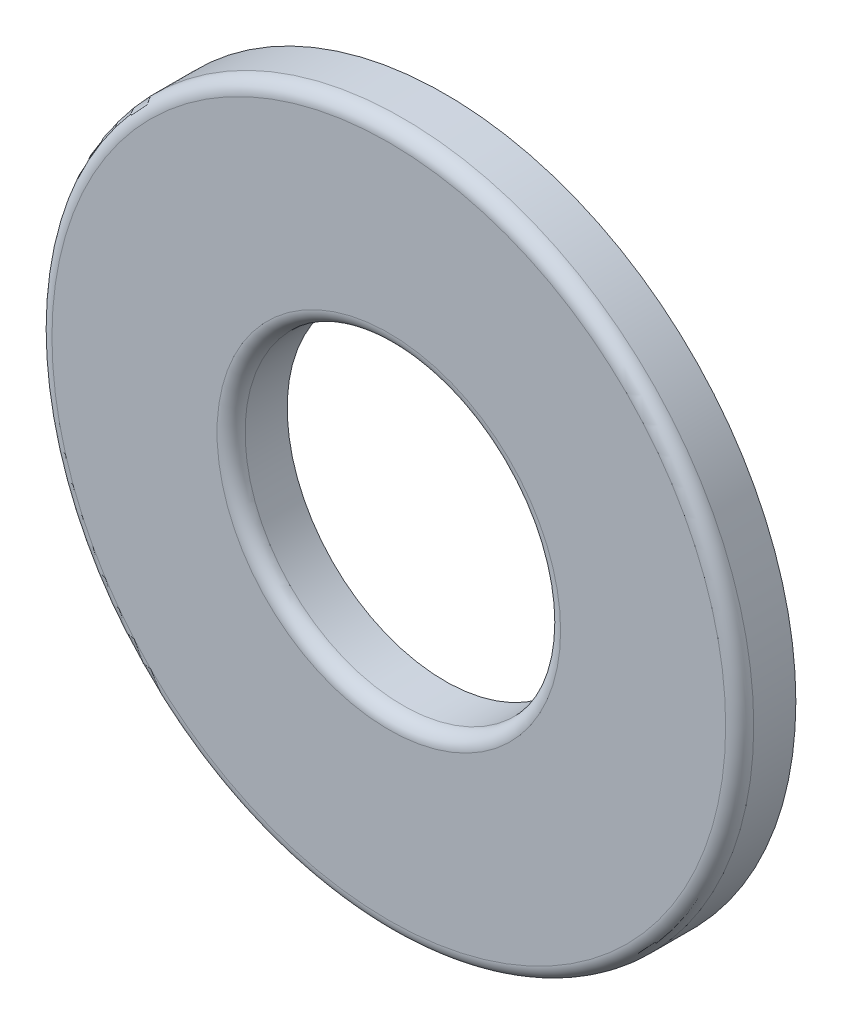
ISO-10303-21;
HEADER;
FILE_DESCRIPTION(('STEP AP214'),'2;1');
FILE_NAME('part.step','',(''),(''),'','','');
FILE_SCHEMA(('AUTOMOTIVE_DESIGN { 1 0 10303 214 1 1 1 1 }'));
ENDSEC;
DATA;
#1=APPLICATION_CONTEXT('core data for automotive mechanical design processes');
#2=APPLICATION_PROTOCOL_DEFINITION('international standard','automotive_design',2000,#1);
#3=PRODUCT_CONTEXT('',#1,'mechanical');
#4=PRODUCT('Part','Part','',(#3));
#5=PRODUCT_RELATED_PRODUCT_CATEGORY('part','',(#4));
#6=PRODUCT_DEFINITION_FORMATION('','',#4);
#7=PRODUCT_DEFINITION_CONTEXT('part definition',#1,'design');
#8=PRODUCT_DEFINITION('design','',#6,#7);
#9=PRODUCT_DEFINITION_SHAPE('','',#8);
#10=(LENGTH_UNIT() NAMED_UNIT(*) SI_UNIT(.MILLI.,.METRE.));
#11=(NAMED_UNIT(*) PLANE_ANGLE_UNIT() SI_UNIT($,.RADIAN.));
#12=(NAMED_UNIT(*) SI_UNIT($,.STERADIAN.) SOLID_ANGLE_UNIT());
#13=UNCERTAINTY_MEASURE_WITH_UNIT(LENGTH_MEASURE(1.E-05),#10,'distance_accuracy_value','');
#14=(GEOMETRIC_REPRESENTATION_CONTEXT(3) GLOBAL_UNCERTAINTY_ASSIGNED_CONTEXT((#13)) GLOBAL_UNIT_ASSIGNED_CONTEXT((#10,
#11,#12)) REPRESENTATION_CONTEXT('',''));
#15=CARTESIAN_POINT('',(0.,0.,0.));
#16=DIRECTION('',(0.,0.,1.));
#17=DIRECTION('',(1.,0.,0.));
#18=AXIS2_PLACEMENT_3D('',#15,#16,#17);
#19=CARTESIAN_POINT('',(0.,0.,0.634999999999997));
#20=DIRECTION('',(0.,0.,1.));
#21=DIRECTION('',(1.,0.,0.));
#22=AXIS2_PLACEMENT_3D('',#19,#20,#21);
#23=PLANE('',#22);
#24=CARTESIAN_POINT('',(0.,0.,0.634999999999997));
#25=DIRECTION('',(0.,0.,1.));
#26=DIRECTION('',(1.,0.,0.));
#27=AXIS2_PLACEMENT_3D('',#24,#25,#26);
#28=CIRCLE('',#27,7.62);
#29=CARTESIAN_POINT('',(7.62,0.,0.634999999999997));
#30=VERTEX_POINT('',#29);
#31=EDGE_CURVE('E50',#30,#30,#28,.T.);
#32=ORIENTED_EDGE('',*,*,#31,.T.);
#33=EDGE_LOOP('',(#32));
#34=FACE_BOUND('',#33,.T.);
#35=CARTESIAN_POINT('',(0.,0.,0.634999999999997));
#36=DIRECTION('',(0.,0.,1.));
#37=DIRECTION('',(1.,0.,0.));
#38=AXIS2_PLACEMENT_3D('',#35,#36,#37);
#39=CIRCLE('',#38,3.8862);
#40=CARTESIAN_POINT('',(3.8862,0.,0.634999999999997));
#41=VERTEX_POINT('',#40);
#42=EDGE_CURVE('E54',#41,#41,#39,.F.);
#43=ORIENTED_EDGE('',*,*,#42,.T.);
#44=EDGE_LOOP('',(#43));
#45=FACE_BOUND('',#44,.T.);
#46=ADVANCED_FACE('F39',(#34,#45),#23,.T.);
#47=CARTESIAN_POINT('',(0.,0.,0.634999999999997));
#48=DIRECTION('',(0.,0.,-1.));
#49=DIRECTION('',(-1.,0.,0.));
#50=AXIS2_PLACEMENT_3D('',#47,#48,#49);
#51=CYLINDRICAL_SURFACE('',#50,7.9375);
#52=CARTESIAN_POINT('',(0.,0.,0.317499999999997));
#53=DIRECTION('',(0.,0.,1.));
#54=DIRECTION('',(1.,0.,0.));
#55=AXIS2_PLACEMENT_3D('',#52,#53,#54);
#56=CIRCLE('',#55,7.9375);
#57=CARTESIAN_POINT('',(7.9375,0.,0.317499999999997));
#58=VERTEX_POINT('',#57);
#59=EDGE_CURVE('E46',#58,#58,#56,.F.);
#60=ORIENTED_EDGE('',*,*,#59,.T.);
#61=EDGE_LOOP('',(#60));
#62=FACE_BOUND('',#61,.T.);
#63=CARTESIAN_POINT('',(0.,0.,-0.635000000000003));
#64=DIRECTION('',(0.,0.,1.));
#65=DIRECTION('',(1.,0.,0.));
#66=AXIS2_PLACEMENT_3D('',#63,#64,#65);
#67=CIRCLE('',#66,7.9375);
#68=CARTESIAN_POINT('',(7.9375,0.,-0.635000000000003));
#69=VERTEX_POINT('',#68);
#70=EDGE_CURVE('E59',#69,#69,#67,.T.);
#71=ORIENTED_EDGE('',*,*,#70,.T.);
#72=EDGE_LOOP('',(#71));
#73=FACE_BOUND('',#72,.T.);
#74=ADVANCED_FACE('F71',(#62,#73),#51,.T.);
#75=CARTESIAN_POINT('',(0.,0.,0.634999999999997));
#76=DIRECTION('',(0.,0.,-1.));
#77=DIRECTION('',(-1.,0.,0.));
#78=AXIS2_PLACEMENT_3D('',#75,#76,#77);
#79=CYLINDRICAL_SURFACE('',#78,3.5687);
#80=CARTESIAN_POINT('',(0.,0.,0.317499999999997));
#81=DIRECTION('',(0.,0.,1.));
#82=DIRECTION('',(1.,0.,0.));
#83=AXIS2_PLACEMENT_3D('',#80,#81,#82);
#84=CIRCLE('',#83,3.5687);
#85=CARTESIAN_POINT('',(3.5687,0.,0.317499999999997));
#86=VERTEX_POINT('',#85);
#87=EDGE_CURVE('E10',#86,#86,#84,.T.);
#88=ORIENTED_EDGE('',*,*,#87,.T.);
#89=EDGE_LOOP('',(#88));
#90=FACE_BOUND('',#89,.T.);
#91=CARTESIAN_POINT('',(0.,0.,-0.635000000000003));
#92=DIRECTION('',(0.,0.,1.));
#93=DIRECTION('',(1.,0.,0.));
#94=AXIS2_PLACEMENT_3D('',#91,#92,#93);
#95=CIRCLE('',#94,3.5687);
#96=CARTESIAN_POINT('',(3.5687,0.,-0.635000000000003));
#97=VERTEX_POINT('',#96);
#98=EDGE_CURVE('E62',#97,#97,#95,.T.);
#99=ORIENTED_EDGE('',*,*,#98,.F.);
#100=EDGE_LOOP('',(#99));
#101=FACE_BOUND('',#100,.T.);
#102=ADVANCED_FACE('F69',(#90,#101),#79,.F.);
#103=CARTESIAN_POINT('',(0.,0.,-0.635000000000003));
#104=DIRECTION('',(0.,0.,1.));
#105=DIRECTION('',(1.,0.,0.));
#106=AXIS2_PLACEMENT_3D('',#103,#104,#105);
#107=PLANE('',#106);
#108=ORIENTED_EDGE('',*,*,#98,.T.);
#109=EDGE_LOOP('',(#108));
#110=FACE_BOUND('',#109,.T.);
#111=ORIENTED_EDGE('',*,*,#70,.F.);
#112=EDGE_LOOP('',(#111));
#113=FACE_BOUND('',#112,.T.);
#114=ADVANCED_FACE('F66',(#110,#113),#107,.F.);
#115=CARTESIAN_POINT('',(0.,0.,0.317499999999997));
#116=DIRECTION('',(0.,0.,1.));
#117=DIRECTION('',(1.,0.,0.));
#118=AXIS2_PLACEMENT_3D('',#115,#116,#117);
#119=TOROIDAL_SURFACE('',#118,7.62,0.3175);
#120=ORIENTED_EDGE('',*,*,#59,.F.);
#121=EDGE_LOOP('',(#120));
#122=FACE_BOUND('',#121,.T.);
#123=ORIENTED_EDGE('',*,*,#31,.F.);
#124=EDGE_LOOP('',(#123));
#125=FACE_BOUND('',#124,.T.);
#126=ADVANCED_FACE('F78',(#122,#125),#119,.T.);
#127=CARTESIAN_POINT('',(0.,0.,0.317499999999997));
#128=DIRECTION('',(0.,0.,1.));
#129=DIRECTION('',(1.,0.,0.));
#130=AXIS2_PLACEMENT_3D('',#127,#128,#129);
#131=TOROIDAL_SURFACE('',#130,3.8862,0.3175);
#132=ORIENTED_EDGE('',*,*,#42,.F.);
#133=EDGE_LOOP('',(#132));
#134=FACE_BOUND('',#133,.T.);
#135=ORIENTED_EDGE('',*,*,#87,.F.);
#136=EDGE_LOOP('',(#135));
#137=FACE_BOUND('',#136,.T.);
#138=ADVANCED_FACE('F41',(#134,#137),#131,.T.);
#139=CLOSED_SHELL('',(#46,#74,#102,#114,#126,#138));
#140=MANIFOLD_SOLID_BREP('B2',#139);
#141=ADVANCED_BREP_SHAPE_REPRESENTATION('',(#18,#140),#14);
#142=SHAPE_DEFINITION_REPRESENTATION(#9,#141);
ENDSEC;
END-ISO-10303-21;
